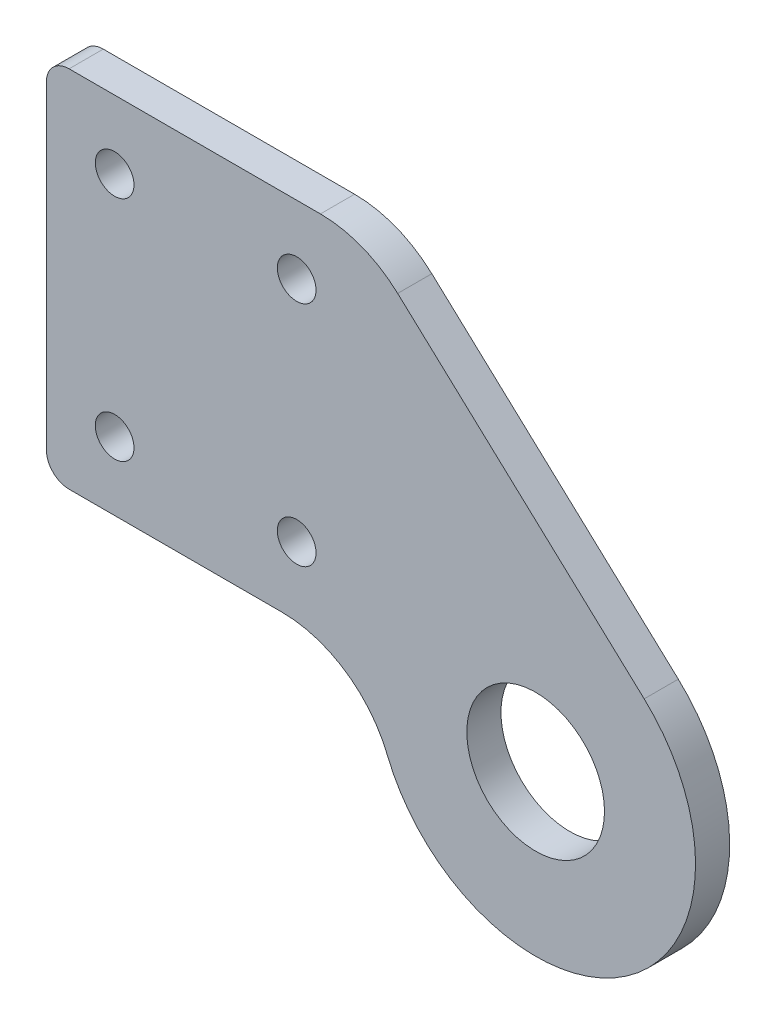
ISO-10303-21;
HEADER;
FILE_DESCRIPTION(('STEP AP214'),'2;1');
FILE_NAME('part.step','',(''),(''),'','','');
FILE_SCHEMA(('AUTOMOTIVE_DESIGN { 1 0 10303 214 1 1 1 1 }'));
ENDSEC;
DATA;
#1=APPLICATION_CONTEXT('core data for automotive mechanical design processes');
#2=APPLICATION_PROTOCOL_DEFINITION('international standard','automotive_design',2000,#1);
#3=PRODUCT_CONTEXT('',#1,'mechanical');
#4=PRODUCT('Part','Part','',(#3));
#5=PRODUCT_RELATED_PRODUCT_CATEGORY('part','',(#4));
#6=PRODUCT_DEFINITION_FORMATION('','',#4);
#7=PRODUCT_DEFINITION_CONTEXT('part definition',#1,'design');
#8=PRODUCT_DEFINITION('design','',#6,#7);
#9=PRODUCT_DEFINITION_SHAPE('','',#8);
#10=(LENGTH_UNIT() NAMED_UNIT(*) SI_UNIT(.MILLI.,.METRE.));
#11=(NAMED_UNIT(*) PLANE_ANGLE_UNIT() SI_UNIT($,.RADIAN.));
#12=(NAMED_UNIT(*) SI_UNIT($,.STERADIAN.) SOLID_ANGLE_UNIT());
#13=UNCERTAINTY_MEASURE_WITH_UNIT(LENGTH_MEASURE(1.E-05),#10,'distance_accuracy_value','');
#14=(GEOMETRIC_REPRESENTATION_CONTEXT(3) GLOBAL_UNCERTAINTY_ASSIGNED_CONTEXT((#13)) GLOBAL_UNIT_ASSIGNED_CONTEXT((#10,
#11,#12)) REPRESENTATION_CONTEXT('',''));
#15=CARTESIAN_POINT('',(0.,0.,0.));
#16=DIRECTION('',(0.,0.,1.));
#17=DIRECTION('',(1.,0.,0.));
#18=AXIS2_PLACEMENT_3D('',#15,#16,#17);
#19=CARTESIAN_POINT('',(0.,0.,0.75));
#20=DIRECTION('',(0.,0.,1.));
#21=DIRECTION('',(1.,0.,0.));
#22=AXIS2_PLACEMENT_3D('',#19,#20,#21);
#23=PLANE('',#22);
#24=CARTESIAN_POINT('',(-10.5,3.5,0.75));
#25=DIRECTION('',(0.,0.,1.));
#26=DIRECTION('',(1.,0.,0.));
#27=AXIS2_PLACEMENT_3D('',#24,#25,#26);
#28=CIRCLE('',#27,0.85);
#29=CARTESIAN_POINT('',(-9.65,3.5,0.75));
#30=VERTEX_POINT('',#29);
#31=EDGE_CURVE('E344',#30,#30,#28,.T.);
#32=ORIENTED_EDGE('',*,*,#31,.F.);
#33=EDGE_LOOP('',(#32));
#34=FACE_BOUND('',#33,.T.);
#35=CARTESIAN_POINT('',(-18.5,13.5,0.75));
#36=DIRECTION('',(0.,0.,1.));
#37=DIRECTION('',(1.,0.,0.));
#38=AXIS2_PLACEMENT_3D('',#35,#36,#37);
#39=CIRCLE('',#38,0.85);
#40=CARTESIAN_POINT('',(-17.65,13.5,0.75));
#41=VERTEX_POINT('',#40);
#42=EDGE_CURVE('E363',#41,#41,#39,.T.);
#43=ORIENTED_EDGE('',*,*,#42,.F.);
#44=EDGE_LOOP('',(#43));
#45=FACE_BOUND('',#44,.T.);
#46=DIRECTION('',(0.,-1.,0.));
#47=VECTOR('',#46,1.);
#48=CARTESIAN_POINT('',(-21.5,16.5,0.75));
#49=LINE('',#48,#47);
#50=CARTESIAN_POINT('',(-21.5,15.5,0.75));
#51=VERTEX_POINT('',#50);
#52=CARTESIAN_POINT('',(-21.5,1.5,0.75));
#53=VERTEX_POINT('',#52);
#54=EDGE_CURVE('E145',#51,#53,#49,.T.);
#55=ORIENTED_EDGE('',*,*,#54,.T.);
#56=CARTESIAN_POINT('',(-20.5,1.5,0.75));
#57=DIRECTION('',(0.,0.,1.));
#58=DIRECTION('',(1.,0.,0.));
#59=AXIS2_PLACEMENT_3D('',#56,#57,#58);
#60=CIRCLE('',#59,1.);
#61=CARTESIAN_POINT('',(-20.5,0.5,0.75));
#62=VERTEX_POINT('',#61);
#63=EDGE_CURVE('E40',#53,#62,#60,.T.);
#64=ORIENTED_EDGE('',*,*,#63,.T.);
#65=DIRECTION('',(1.,0.,0.));
#66=VECTOR('',#65,1.);
#67=CARTESIAN_POINT('',(-21.5,0.5,0.75));
#68=LINE('',#67,#66);
#69=CARTESIAN_POINT('',(-11.1512611394407,0.5,0.75));
#70=VERTEX_POINT('',#69);
#71=EDGE_CURVE('E116',#62,#70,#68,.T.);
#72=ORIENTED_EDGE('',*,*,#71,.T.);
#73=CARTESIAN_POINT('',(-11.1512611394407,-4.5,0.75));
#74=DIRECTION('',(0.,0.,1.));
#75=DIRECTION('',(1.,0.,0.));
#76=AXIS2_PLACEMENT_3D('',#73,#74,#75);
#77=CIRCLE('',#76,5.);
#78=CARTESIAN_POINT('',(-6.51456212096223,-2.62889812889813,0.75));
#79=VERTEX_POINT('',#78);
#80=EDGE_CURVE('E112',#70,#79,#77,.F.);
#81=ORIENTED_EDGE('',*,*,#80,.T.);
#82=CARTESIAN_POINT('',(0.,0.,0.75));
#83=DIRECTION('',(0.,0.,1.));
#84=DIRECTION('',(1.,0.,0.));
#85=AXIS2_PLACEMENT_3D('',#82,#83,#84);
#86=CIRCLE('',#85,7.025);
#87=CARTESIAN_POINT('',(4.76867274630396,5.15852549074422,0.75));
#88=VERTEX_POINT('',#87);
#89=EDGE_CURVE('E105',#79,#88,#86,.T.);
#90=ORIENTED_EDGE('',*,*,#89,.T.);
#91=DIRECTION('',(-0.734309678397754,0.678814625808392,0.));
#92=VECTOR('',#91,1.);
#93=CARTESIAN_POINT('',(-7.5,16.5,0.75));
#94=LINE('',#93,#92);
#95=CARTESIAN_POINT('',(-6.06294364328995,15.1715483919888,0.75));
#96=VERTEX_POINT('',#95);
#97=EDGE_CURVE('E109',#88,#96,#94,.T.);
#98=ORIENTED_EDGE('',*,*,#97,.T.);
#99=CARTESIAN_POINT('',(-9.4570167723319,11.5,0.75));
#100=DIRECTION('',(0.,0.,1.));
#101=DIRECTION('',(1.,0.,0.));
#102=AXIS2_PLACEMENT_3D('',#99,#100,#101);
#103=CIRCLE('',#102,5.);
#104=CARTESIAN_POINT('',(-9.4570167723319,16.5,0.75));
#105=VERTEX_POINT('',#104);
#106=EDGE_CURVE('E157',#96,#105,#103,.T.);
#107=ORIENTED_EDGE('',*,*,#106,.T.);
#108=DIRECTION('',(-1.,0.,0.));
#109=VECTOR('',#108,1.);
#110=CARTESIAN_POINT('',(-21.5,16.5,0.75));
#111=LINE('',#110,#109);
#112=CARTESIAN_POINT('',(-20.5,16.5,0.75));
#113=VERTEX_POINT('',#112);
#114=EDGE_CURVE('E127',#105,#113,#111,.T.);
#115=ORIENTED_EDGE('',*,*,#114,.T.);
#116=CARTESIAN_POINT('',(-20.5,15.5,0.75));
#117=DIRECTION('',(0.,0.,1.));
#118=DIRECTION('',(1.,0.,0.));
#119=AXIS2_PLACEMENT_3D('',#116,#117,#118);
#120=CIRCLE('',#119,1.);
#121=EDGE_CURVE('E174',#113,#51,#120,.T.);
#122=ORIENTED_EDGE('',*,*,#121,.T.);
#123=EDGE_LOOP('',(#55,#64,#72,#81,#90,#98,#107,#115,#122));
#124=FACE_BOUND('',#123,.T.);
#125=CARTESIAN_POINT('',(0.,0.,0.75));
#126=DIRECTION('',(0.,0.,1.));
#127=DIRECTION('',(1.,0.,0.));
#128=AXIS2_PLACEMENT_3D('',#125,#126,#127);
#129=CIRCLE('',#128,3.025);
#130=CARTESIAN_POINT('',(3.025,0.,0.75));
#131=VERTEX_POINT('',#130);
#132=EDGE_CURVE('E139',#131,#131,#129,.T.);
#133=ORIENTED_EDGE('',*,*,#132,.F.);
#134=EDGE_LOOP('',(#133));
#135=FACE_BOUND('',#134,.T.);
#136=CARTESIAN_POINT('',(-10.5,13.5,0.75));
#137=DIRECTION('',(0.,0.,1.));
#138=DIRECTION('',(1.,0.,0.));
#139=AXIS2_PLACEMENT_3D('',#136,#137,#138);
#140=CIRCLE('',#139,0.85);
#141=CARTESIAN_POINT('',(-9.65,13.5,0.75));
#142=VERTEX_POINT('',#141);
#143=EDGE_CURVE('E357',#142,#142,#140,.T.);
#144=ORIENTED_EDGE('',*,*,#143,.F.);
#145=EDGE_LOOP('',(#144));
#146=FACE_BOUND('',#145,.T.);
#147=CARTESIAN_POINT('',(-18.5,3.5,0.75));
#148=DIRECTION('',(0.,0.,1.));
#149=DIRECTION('',(1.,0.,0.));
#150=AXIS2_PLACEMENT_3D('',#147,#148,#149);
#151=CIRCLE('',#150,0.85);
#152=CARTESIAN_POINT('',(-17.65,3.5,0.75));
#153=VERTEX_POINT('',#152);
#154=EDGE_CURVE('E348',#153,#153,#151,.T.);
#155=ORIENTED_EDGE('',*,*,#154,.F.);
#156=EDGE_LOOP('',(#155));
#157=FACE_BOUND('',#156,.T.);
#158=ADVANCED_FACE('F32',(#34,#45,#124,#135,#146,#157),#23,.T.);
#159=CARTESIAN_POINT('',(0.,0.,-0.75));
#160=DIRECTION('',(0.,0.,1.));
#161=DIRECTION('',(1.,0.,0.));
#162=AXIS2_PLACEMENT_3D('',#159,#160,#161);
#163=PLANE('',#162);
#164=CARTESIAN_POINT('',(-10.5,3.5,-0.75));
#165=DIRECTION('',(0.,0.,1.));
#166=DIRECTION('',(1.,0.,0.));
#167=AXIS2_PLACEMENT_3D('',#164,#165,#166);
#168=CIRCLE('',#167,0.85);
#169=CARTESIAN_POINT('',(-9.65,3.5,-0.75));
#170=VERTEX_POINT('',#169);
#171=EDGE_CURVE('E347',#170,#170,#168,.T.);
#172=ORIENTED_EDGE('',*,*,#171,.T.);
#173=EDGE_LOOP('',(#172));
#174=FACE_BOUND('',#173,.T.);
#175=CARTESIAN_POINT('',(-18.5,13.5,-0.75));
#176=DIRECTION('',(0.,0.,1.));
#177=DIRECTION('',(1.,0.,0.));
#178=AXIS2_PLACEMENT_3D('',#175,#176,#177);
#179=CIRCLE('',#178,0.85);
#180=CARTESIAN_POINT('',(-17.65,13.5,-0.75));
#181=VERTEX_POINT('',#180);
#182=EDGE_CURVE('E360',#181,#181,#179,.T.);
#183=ORIENTED_EDGE('',*,*,#182,.T.);
#184=EDGE_LOOP('',(#183));
#185=FACE_BOUND('',#184,.T.);
#186=DIRECTION('',(1.,0.,0.));
#187=VECTOR('',#186,1.);
#188=CARTESIAN_POINT('',(-7.5,0.5,-0.75));
#189=LINE('',#188,#187);
#190=CARTESIAN_POINT('',(-20.5,0.5,-0.75));
#191=VERTEX_POINT('',#190);
#192=CARTESIAN_POINT('',(-11.1512611394407,0.5,-0.75));
#193=VERTEX_POINT('',#192);
#194=EDGE_CURVE('E138',#191,#193,#189,.T.);
#195=ORIENTED_EDGE('',*,*,#194,.F.);
#196=CARTESIAN_POINT('',(-20.5,1.5,-0.75));
#197=DIRECTION('',(0.,0.,1.));
#198=DIRECTION('',(1.,0.,0.));
#199=AXIS2_PLACEMENT_3D('',#196,#197,#198);
#200=CIRCLE('',#199,1.);
#201=CARTESIAN_POINT('',(-21.5,1.5,-0.75));
#202=VERTEX_POINT('',#201);
#203=EDGE_CURVE('E168',#191,#202,#200,.F.);
#204=ORIENTED_EDGE('',*,*,#203,.T.);
#205=DIRECTION('',(0.,-1.,0.));
#206=VECTOR('',#205,1.);
#207=CARTESIAN_POINT('',(-21.5,16.5,-0.75));
#208=LINE('',#207,#206);
#209=CARTESIAN_POINT('',(-21.5,15.5,-0.75));
#210=VERTEX_POINT('',#209);
#211=EDGE_CURVE('E136',#210,#202,#208,.T.);
#212=ORIENTED_EDGE('',*,*,#211,.F.);
#213=CARTESIAN_POINT('',(-20.5,15.5,-0.75));
#214=DIRECTION('',(0.,0.,1.));
#215=DIRECTION('',(1.,0.,0.));
#216=AXIS2_PLACEMENT_3D('',#213,#214,#215);
#217=CIRCLE('',#216,1.);
#218=CARTESIAN_POINT('',(-20.5,16.5,-0.75));
#219=VERTEX_POINT('',#218);
#220=EDGE_CURVE('E166',#210,#219,#217,.F.);
#221=ORIENTED_EDGE('',*,*,#220,.T.);
#222=DIRECTION('',(-1.,0.,0.));
#223=VECTOR('',#222,1.);
#224=CARTESIAN_POINT('',(-21.5,16.5,-0.75));
#225=LINE('',#224,#223);
#226=CARTESIAN_POINT('',(-9.4570167723319,16.5,-0.75));
#227=VERTEX_POINT('',#226);
#228=EDGE_CURVE('E144',#227,#219,#225,.T.);
#229=ORIENTED_EDGE('',*,*,#228,.F.);
#230=CARTESIAN_POINT('',(-9.4570167723319,11.5,-0.75));
#231=DIRECTION('',(0.,0.,1.));
#232=DIRECTION('',(1.,0.,0.));
#233=AXIS2_PLACEMENT_3D('',#230,#231,#232);
#234=CIRCLE('',#233,5.);
#235=CARTESIAN_POINT('',(-6.06294364328995,15.1715483919888,-0.75));
#236=VERTEX_POINT('',#235);
#237=EDGE_CURVE('E154',#227,#236,#234,.F.);
#238=ORIENTED_EDGE('',*,*,#237,.T.);
#239=DIRECTION('',(-0.734309678397754,0.678814625808392,0.));
#240=VECTOR('',#239,1.);
#241=CARTESIAN_POINT('',(-7.5,16.5,-0.75));
#242=LINE('',#241,#240);
#243=CARTESIAN_POINT('',(4.76867274630396,5.15852549074422,-0.75));
#244=VERTEX_POINT('',#243);
#245=EDGE_CURVE('E142',#244,#236,#242,.T.);
#246=ORIENTED_EDGE('',*,*,#245,.F.);
#247=CARTESIAN_POINT('',(0.,0.,-0.75));
#248=DIRECTION('',(0.,0.,1.));
#249=DIRECTION('',(1.,0.,0.));
#250=AXIS2_PLACEMENT_3D('',#247,#248,#249);
#251=CIRCLE('',#250,7.025);
#252=CARTESIAN_POINT('',(-6.51456212096223,-2.62889812889813,-0.75));
#253=VERTEX_POINT('',#252);
#254=EDGE_CURVE('E122',#253,#244,#251,.T.);
#255=ORIENTED_EDGE('',*,*,#254,.F.);
#256=CARTESIAN_POINT('',(-11.1512611394407,-4.5,-0.75));
#257=DIRECTION('',(0.,0.,1.));
#258=DIRECTION('',(1.,0.,0.));
#259=AXIS2_PLACEMENT_3D('',#256,#257,#258);
#260=CIRCLE('',#259,5.);
#261=EDGE_CURVE('E159',#253,#193,#260,.T.);
#262=ORIENTED_EDGE('',*,*,#261,.T.);
#263=EDGE_LOOP('',(#195,#204,#212,#221,#229,#238,#246,#255,#262));
#264=FACE_BOUND('',#263,.T.);
#265=CARTESIAN_POINT('',(0.,0.,-0.75));
#266=DIRECTION('',(0.,0.,1.));
#267=DIRECTION('',(1.,0.,0.));
#268=AXIS2_PLACEMENT_3D('',#265,#266,#267);
#269=CIRCLE('',#268,3.025);
#270=CARTESIAN_POINT('',(3.025,0.,-0.75));
#271=VERTEX_POINT('',#270);
#272=EDGE_CURVE('E366',#271,#271,#269,.T.);
#273=ORIENTED_EDGE('',*,*,#272,.T.);
#274=EDGE_LOOP('',(#273));
#275=FACE_BOUND('',#274,.T.);
#276=CARTESIAN_POINT('',(-10.5,13.5,-0.75));
#277=DIRECTION('',(0.,0.,1.));
#278=DIRECTION('',(1.,0.,0.));
#279=AXIS2_PLACEMENT_3D('',#276,#277,#278);
#280=CIRCLE('',#279,0.85);
#281=CARTESIAN_POINT('',(-9.65,13.5,-0.75));
#282=VERTEX_POINT('',#281);
#283=EDGE_CURVE('E350',#282,#282,#280,.T.);
#284=ORIENTED_EDGE('',*,*,#283,.T.);
#285=EDGE_LOOP('',(#284));
#286=FACE_BOUND('',#285,.T.);
#287=CARTESIAN_POINT('',(-18.5,3.5,-0.75));
#288=DIRECTION('',(0.,0.,1.));
#289=DIRECTION('',(1.,0.,0.));
#290=AXIS2_PLACEMENT_3D('',#287,#288,#289);
#291=CIRCLE('',#290,0.85);
#292=CARTESIAN_POINT('',(-17.65,3.5,-0.75));
#293=VERTEX_POINT('',#292);
#294=EDGE_CURVE('E353',#293,#293,#291,.T.);
#295=ORIENTED_EDGE('',*,*,#294,.T.);
#296=EDGE_LOOP('',(#295));
#297=FACE_BOUND('',#296,.T.);
#298=ADVANCED_FACE('F186',(#174,#185,#264,#275,#286,#297),#163,.F.);
#299=CARTESIAN_POINT('',(-21.5,16.5,0.75));
#300=DIRECTION('',(1.,0.,0.));
#301=DIRECTION('',(0.,1.,0.));
#302=AXIS2_PLACEMENT_3D('',#299,#300,#301);
#303=PLANE('',#302);
#304=ORIENTED_EDGE('',*,*,#211,.T.);
#305=DIRECTION('',(0.,0.,-1.));
#306=VECTOR('',#305,1.);
#307=CARTESIAN_POINT('',(-21.5,1.5,0.75));
#308=LINE('',#307,#306);
#309=EDGE_CURVE('E53',#202,#53,#308,.F.);
#310=ORIENTED_EDGE('',*,*,#309,.T.);
#311=ORIENTED_EDGE('',*,*,#54,.F.);
#312=DIRECTION('',(0.,0.,-1.));
#313=VECTOR('',#312,1.);
#314=CARTESIAN_POINT('',(-21.5,15.5,0.75));
#315=LINE('',#314,#313);
#316=EDGE_CURVE('E170',#51,#210,#315,.T.);
#317=ORIENTED_EDGE('',*,*,#316,.T.);
#318=EDGE_LOOP('',(#304,#310,#311,#317));
#319=FACE_BOUND('',#318,.T.);
#320=ADVANCED_FACE('F188',(#319),#303,.F.);
#321=CARTESIAN_POINT('',(-7.5,0.5,0.75));
#322=DIRECTION('',(0.,1.,0.));
#323=DIRECTION('',(0.,0.,1.));
#324=AXIS2_PLACEMENT_3D('',#321,#322,#323);
#325=PLANE('',#324);
#326=ORIENTED_EDGE('',*,*,#71,.F.);
#327=DIRECTION('',(0.,0.,-1.));
#328=VECTOR('',#327,1.);
#329=CARTESIAN_POINT('',(-20.5,0.5,0.75));
#330=LINE('',#329,#328);
#331=EDGE_CURVE('E163',#62,#191,#330,.T.);
#332=ORIENTED_EDGE('',*,*,#331,.T.);
#333=ORIENTED_EDGE('',*,*,#194,.T.);
#334=DIRECTION('',(0.,0.,1.));
#335=VECTOR('',#334,1.);
#336=CARTESIAN_POINT('',(-11.1512611394407,0.5,0.75));
#337=LINE('',#336,#335);
#338=EDGE_CURVE('E148',#193,#70,#337,.T.);
#339=ORIENTED_EDGE('',*,*,#338,.T.);
#340=EDGE_LOOP('',(#326,#332,#333,#339));
#341=FACE_BOUND('',#340,.T.);
#342=ADVANCED_FACE('F180',(#341),#325,.F.);
#343=CARTESIAN_POINT('',(0.,0.,0.75));
#344=DIRECTION('',(0.,0.,-1.));
#345=DIRECTION('',(-1.,0.,0.));
#346=AXIS2_PLACEMENT_3D('',#343,#344,#345);
#347=CYLINDRICAL_SURFACE('',#346,7.025);
#348=ORIENTED_EDGE('',*,*,#89,.F.);
#349=DIRECTION('',(0.,0.,-1.));
#350=VECTOR('',#349,1.);
#351=CARTESIAN_POINT('',(-6.51456212096223,-2.62889812889813,0.75));
#352=LINE('',#351,#350);
#353=EDGE_CURVE('E126',#79,#253,#352,.T.);
#354=ORIENTED_EDGE('',*,*,#353,.T.);
#355=ORIENTED_EDGE('',*,*,#254,.T.);
#356=DIRECTION('',(0.,0.,-1.));
#357=VECTOR('',#356,1.);
#358=CARTESIAN_POINT('',(4.76867274630396,5.15852549074422,0.75));
#359=LINE('',#358,#357);
#360=EDGE_CURVE('E119',#88,#244,#359,.T.);
#361=ORIENTED_EDGE('',*,*,#360,.F.);
#362=EDGE_LOOP('',(#348,#354,#355,#361));
#363=FACE_BOUND('',#362,.T.);
#364=ADVANCED_FACE('F120',(#363),#347,.T.);
#365=CARTESIAN_POINT('',(-7.5,16.5,0.75));
#366=DIRECTION('',(-0.678814625808392,-0.734309678397754,0.));
#367=DIRECTION('',(0.734309678397754,-0.678814625808392,0.));
#368=AXIS2_PLACEMENT_3D('',#365,#366,#367);
#369=PLANE('',#368);
#370=ORIENTED_EDGE('',*,*,#245,.T.);
#371=DIRECTION('',(0.,0.,-1.));
#372=VECTOR('',#371,1.);
#373=CARTESIAN_POINT('',(-6.06294364328995,15.1715483919888,0.75));
#374=LINE('',#373,#372);
#375=EDGE_CURVE('E131',#236,#96,#374,.F.);
#376=ORIENTED_EDGE('',*,*,#375,.T.);
#377=ORIENTED_EDGE('',*,*,#97,.F.);
#378=ORIENTED_EDGE('',*,*,#360,.T.);
#379=EDGE_LOOP('',(#370,#376,#377,#378));
#380=FACE_BOUND('',#379,.T.);
#381=ADVANCED_FACE('F129',(#380),#369,.F.);
#382=CARTESIAN_POINT('',(-21.5,16.5,0.75));
#383=DIRECTION('',(0.,-1.,0.));
#384=DIRECTION('',(0.,0.,-1.));
#385=AXIS2_PLACEMENT_3D('',#382,#383,#384);
#386=PLANE('',#385);
#387=ORIENTED_EDGE('',*,*,#228,.T.);
#388=DIRECTION('',(0.,0.,-1.));
#389=VECTOR('',#388,1.);
#390=CARTESIAN_POINT('',(-20.5,16.5,0.75));
#391=LINE('',#390,#389);
#392=EDGE_CURVE('E11',#219,#113,#391,.F.);
#393=ORIENTED_EDGE('',*,*,#392,.T.);
#394=ORIENTED_EDGE('',*,*,#114,.F.);
#395=DIRECTION('',(0.,0.,-1.));
#396=VECTOR('',#395,1.);
#397=CARTESIAN_POINT('',(-9.4570167723319,16.5,0.75));
#398=LINE('',#397,#396);
#399=EDGE_CURVE('E151',#105,#227,#398,.T.);
#400=ORIENTED_EDGE('',*,*,#399,.T.);
#401=EDGE_LOOP('',(#387,#393,#394,#400));
#402=FACE_BOUND('',#401,.T.);
#403=ADVANCED_FACE('F193',(#402),#386,.F.);
#404=CARTESIAN_POINT('',(0.,0.,0.75));
#405=DIRECTION('',(0.,0.,-1.));
#406=DIRECTION('',(-1.,0.,0.));
#407=AXIS2_PLACEMENT_3D('',#404,#405,#406);
#408=CYLINDRICAL_SURFACE('',#407,3.025);
#409=ORIENTED_EDGE('',*,*,#132,.T.);
#410=EDGE_LOOP('',(#409));
#411=FACE_BOUND('',#410,.T.);
#412=ORIENTED_EDGE('',*,*,#272,.F.);
#413=EDGE_LOOP('',(#412));
#414=FACE_BOUND('',#413,.T.);
#415=ADVANCED_FACE('F222',(#411,#414),#408,.F.);
#416=CARTESIAN_POINT('',(-18.5,13.5,0.75));
#417=DIRECTION('',(0.,0.,-1.));
#418=DIRECTION('',(-1.,0.,0.));
#419=AXIS2_PLACEMENT_3D('',#416,#417,#418);
#420=CYLINDRICAL_SURFACE('',#419,0.85);
#421=ORIENTED_EDGE('',*,*,#42,.T.);
#422=EDGE_LOOP('',(#421));
#423=FACE_BOUND('',#422,.T.);
#424=ORIENTED_EDGE('',*,*,#182,.F.);
#425=EDGE_LOOP('',(#424));
#426=FACE_BOUND('',#425,.T.);
#427=ADVANCED_FACE('F261',(#423,#426),#420,.F.);
#428=CARTESIAN_POINT('',(-10.5,13.5,0.75));
#429=DIRECTION('',(0.,0.,-1.));
#430=DIRECTION('',(-1.,0.,0.));
#431=AXIS2_PLACEMENT_3D('',#428,#429,#430);
#432=CYLINDRICAL_SURFACE('',#431,0.85);
#433=ORIENTED_EDGE('',*,*,#143,.T.);
#434=EDGE_LOOP('',(#433));
#435=FACE_BOUND('',#434,.T.);
#436=ORIENTED_EDGE('',*,*,#283,.F.);
#437=EDGE_LOOP('',(#436));
#438=FACE_BOUND('',#437,.T.);
#439=ADVANCED_FACE('F268',(#435,#438),#432,.F.);
#440=CARTESIAN_POINT('',(-10.5,3.5,0.75));
#441=DIRECTION('',(0.,0.,-1.));
#442=DIRECTION('',(-1.,0.,0.));
#443=AXIS2_PLACEMENT_3D('',#440,#441,#442);
#444=CYLINDRICAL_SURFACE('',#443,0.85);
#445=ORIENTED_EDGE('',*,*,#31,.T.);
#446=EDGE_LOOP('',(#445));
#447=FACE_BOUND('',#446,.T.);
#448=ORIENTED_EDGE('',*,*,#171,.F.);
#449=EDGE_LOOP('',(#448));
#450=FACE_BOUND('',#449,.T.);
#451=ADVANCED_FACE('F207',(#447,#450),#444,.F.);
#452=CARTESIAN_POINT('',(-18.5,3.5,0.75));
#453=DIRECTION('',(0.,0.,-1.));
#454=DIRECTION('',(-1.,0.,0.));
#455=AXIS2_PLACEMENT_3D('',#452,#453,#454);
#456=CYLINDRICAL_SURFACE('',#455,0.85);
#457=ORIENTED_EDGE('',*,*,#154,.T.);
#458=EDGE_LOOP('',(#457));
#459=FACE_BOUND('',#458,.T.);
#460=ORIENTED_EDGE('',*,*,#294,.F.);
#461=EDGE_LOOP('',(#460));
#462=FACE_BOUND('',#461,.T.);
#463=ADVANCED_FACE('F200',(#459,#462),#456,.F.);
#464=CARTESIAN_POINT('',(-11.1512611394407,-4.5,0.75));
#465=DIRECTION('',(0.,0.,-1.));
#466=DIRECTION('',(-1.,0.,0.));
#467=AXIS2_PLACEMENT_3D('',#464,#465,#466);
#468=CYLINDRICAL_SURFACE('',#467,5.);
#469=ORIENTED_EDGE('',*,*,#80,.F.);
#470=ORIENTED_EDGE('',*,*,#338,.F.);
#471=ORIENTED_EDGE('',*,*,#261,.F.);
#472=ORIENTED_EDGE('',*,*,#353,.F.);
#473=EDGE_LOOP('',(#469,#470,#471,#472));
#474=FACE_BOUND('',#473,.T.);
#475=ADVANCED_FACE('F198',(#474),#468,.F.);
#476=CARTESIAN_POINT('',(-9.4570167723319,11.5,0.75));
#477=DIRECTION('',(0.,0.,-1.));
#478=DIRECTION('',(-1.,0.,0.));
#479=AXIS2_PLACEMENT_3D('',#476,#477,#478);
#480=CYLINDRICAL_SURFACE('',#479,5.);
#481=ORIENTED_EDGE('',*,*,#106,.F.);
#482=ORIENTED_EDGE('',*,*,#375,.F.);
#483=ORIENTED_EDGE('',*,*,#237,.F.);
#484=ORIENTED_EDGE('',*,*,#399,.F.);
#485=EDGE_LOOP('',(#481,#482,#483,#484));
#486=FACE_BOUND('',#485,.T.);
#487=ADVANCED_FACE('F196',(#486),#480,.T.);
#488=CARTESIAN_POINT('',(-20.5,1.5,0.75));
#489=DIRECTION('',(0.,0.,-1.));
#490=DIRECTION('',(-1.,0.,0.));
#491=AXIS2_PLACEMENT_3D('',#488,#489,#490);
#492=CYLINDRICAL_SURFACE('',#491,1.);
#493=ORIENTED_EDGE('',*,*,#63,.F.);
#494=ORIENTED_EDGE('',*,*,#309,.F.);
#495=ORIENTED_EDGE('',*,*,#203,.F.);
#496=ORIENTED_EDGE('',*,*,#331,.F.);
#497=EDGE_LOOP('',(#493,#494,#495,#496));
#498=FACE_BOUND('',#497,.T.);
#499=ADVANCED_FACE('F183',(#498),#492,.T.);
#500=CARTESIAN_POINT('',(-20.5,15.5,0.75));
#501=DIRECTION('',(0.,0.,-1.));
#502=DIRECTION('',(-1.,0.,0.));
#503=AXIS2_PLACEMENT_3D('',#500,#501,#502);
#504=CYLINDRICAL_SURFACE('',#503,1.);
#505=ORIENTED_EDGE('',*,*,#121,.F.);
#506=ORIENTED_EDGE('',*,*,#392,.F.);
#507=ORIENTED_EDGE('',*,*,#220,.F.);
#508=ORIENTED_EDGE('',*,*,#316,.F.);
#509=EDGE_LOOP('',(#505,#506,#507,#508));
#510=FACE_BOUND('',#509,.T.);
#511=ADVANCED_FACE('F34',(#510),#504,.T.);
#512=CLOSED_SHELL('',(#158,#298,#320,#342,#364,#381,#403,#415,#427,#439,#451,#463,#475,#487,
#499,#511));
#513=MANIFOLD_SOLID_BREP('B2',#512);
#514=ADVANCED_BREP_SHAPE_REPRESENTATION('',(#18,#513),#14);
#515=SHAPE_DEFINITION_REPRESENTATION(#9,#514);
ENDSEC;
END-ISO-10303-21;
